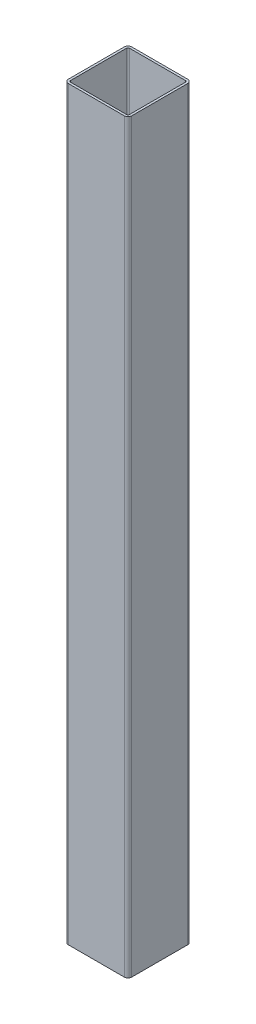
ISO-10303-21;
HEADER;
FILE_DESCRIPTION(('STEP AP214'),'2;1');
FILE_NAME('part.step','',(''),(''),'','','');
FILE_SCHEMA(('AUTOMOTIVE_DESIGN { 1 0 10303 214 1 1 1 1 }'));
ENDSEC;
DATA;
#1=APPLICATION_CONTEXT('core data for automotive mechanical design processes');
#2=APPLICATION_PROTOCOL_DEFINITION('international standard','automotive_design',2000,#1);
#3=PRODUCT_CONTEXT('',#1,'mechanical');
#4=PRODUCT('Part','Part','',(#3));
#5=PRODUCT_RELATED_PRODUCT_CATEGORY('part','',(#4));
#6=PRODUCT_DEFINITION_FORMATION('','',#4);
#7=PRODUCT_DEFINITION_CONTEXT('part definition',#1,'design');
#8=PRODUCT_DEFINITION('design','',#6,#7);
#9=PRODUCT_DEFINITION_SHAPE('','',#8);
#10=(LENGTH_UNIT() NAMED_UNIT(*) SI_UNIT(.MILLI.,.METRE.));
#11=(NAMED_UNIT(*) PLANE_ANGLE_UNIT() SI_UNIT($,.RADIAN.));
#12=(NAMED_UNIT(*) SI_UNIT($,.STERADIAN.) SOLID_ANGLE_UNIT());
#13=UNCERTAINTY_MEASURE_WITH_UNIT(LENGTH_MEASURE(1.E-05),#10,'distance_accuracy_value','');
#14=(GEOMETRIC_REPRESENTATION_CONTEXT(3) GLOBAL_UNCERTAINTY_ASSIGNED_CONTEXT((#13)) GLOBAL_UNIT_ASSIGNED_CONTEXT((#10,
#11,#12)) REPRESENTATION_CONTEXT('',''));
#15=CARTESIAN_POINT('',(0.,0.,0.));
#16=DIRECTION('',(0.,0.,1.));
#17=DIRECTION('',(1.,0.,0.));
#18=AXIS2_PLACEMENT_3D('',#15,#16,#17);
#19=CARTESIAN_POINT('',(37.5,1000.,37.5));
#20=DIRECTION('',(0.,1.,0.));
#21=DIRECTION('',(0.,0.,1.));
#22=AXIS2_PLACEMENT_3D('',#19,#20,#21);
#23=PLANE('',#22);
#24=CARTESIAN_POINT('',(37.5,1000.,37.5));
#25=DIRECTION('',(0.,1.,0.));
#26=DIRECTION('',(0.,0.,1.));
#27=AXIS2_PLACEMENT_3D('',#24,#25,#26);
#28=CIRCLE('',#27,4.99999999999999);
#29=CARTESIAN_POINT('',(37.5,1000.,42.5));
#30=VERTEX_POINT('',#29);
#31=CARTESIAN_POINT('',(42.5,1000.,37.5));
#32=VERTEX_POINT('',#31);
#33=EDGE_CURVE('E262',#30,#32,#28,.T.);
#34=ORIENTED_EDGE('',*,*,#33,.T.);
#35=DIRECTION('',(0.,0.,-1.));
#36=VECTOR('',#35,1.);
#37=CARTESIAN_POINT('',(42.5,1000.,-37.5));
#38=LINE('',#37,#36);
#39=CARTESIAN_POINT('',(42.5,1000.,-37.5));
#40=VERTEX_POINT('',#39);
#41=EDGE_CURVE('E265',#32,#40,#38,.T.);
#42=ORIENTED_EDGE('',*,*,#41,.T.);
#43=CARTESIAN_POINT('',(37.5,1000.,-37.5));
#44=DIRECTION('',(0.,1.,0.));
#45=DIRECTION('',(0.,0.,-1.));
#46=AXIS2_PLACEMENT_3D('',#43,#44,#45);
#47=CIRCLE('',#46,5.);
#48=CARTESIAN_POINT('',(37.5,1000.,-42.5));
#49=VERTEX_POINT('',#48);
#50=EDGE_CURVE('E268',#40,#49,#47,.T.);
#51=ORIENTED_EDGE('',*,*,#50,.T.);
#52=DIRECTION('',(-1.,0.,0.));
#53=VECTOR('',#52,1.);
#54=CARTESIAN_POINT('',(-37.5,1000.,-42.5));
#55=LINE('',#54,#53);
#56=CARTESIAN_POINT('',(-37.5,1000.,-42.5));
#57=VERTEX_POINT('',#56);
#58=EDGE_CURVE('E270',#49,#57,#55,.T.);
#59=ORIENTED_EDGE('',*,*,#58,.T.);
#60=CARTESIAN_POINT('',(-37.5,1000.,-37.5));
#61=DIRECTION('',(0.,1.,0.));
#62=DIRECTION('',(0.,0.,1.));
#63=AXIS2_PLACEMENT_3D('',#60,#61,#62);
#64=CIRCLE('',#63,5.);
#65=CARTESIAN_POINT('',(-42.5,1000.,-37.5));
#66=VERTEX_POINT('',#65);
#67=EDGE_CURVE('E272',#57,#66,#64,.T.);
#68=ORIENTED_EDGE('',*,*,#67,.T.);
#69=DIRECTION('',(0.,0.,1.));
#70=VECTOR('',#69,1.);
#71=CARTESIAN_POINT('',(-42.5,1000.,-37.5));
#72=LINE('',#71,#70);
#73=CARTESIAN_POINT('',(-42.5,1000.,37.5));
#74=VERTEX_POINT('',#73);
#75=EDGE_CURVE('E274',#66,#74,#72,.T.);
#76=ORIENTED_EDGE('',*,*,#75,.T.);
#77=CARTESIAN_POINT('',(-37.5,1000.,37.5));
#78=DIRECTION('',(0.,1.,0.));
#79=DIRECTION('',(0.,0.,1.));
#80=AXIS2_PLACEMENT_3D('',#77,#78,#79);
#81=CIRCLE('',#80,5.);
#82=CARTESIAN_POINT('',(-37.5,1000.,42.5));
#83=VERTEX_POINT('',#82);
#84=EDGE_CURVE('E276',#74,#83,#81,.T.);
#85=ORIENTED_EDGE('',*,*,#84,.T.);
#86=DIRECTION('',(1.,0.,0.));
#87=VECTOR('',#86,1.);
#88=CARTESIAN_POINT('',(-37.5,1000.,42.5));
#89=LINE('',#88,#87);
#90=EDGE_CURVE('E278',#83,#30,#89,.T.);
#91=ORIENTED_EDGE('',*,*,#90,.T.);
#92=EDGE_LOOP('',(#34,#42,#51,#59,#68,#76,#85,#91));
#93=FACE_BOUND('',#92,.T.);
#94=DIRECTION('',(0.,0.,-1.));
#95=VECTOR('',#94,1.);
#96=CARTESIAN_POINT('',(39.5,1000.,-37.5));
#97=LINE('',#96,#95);
#98=CARTESIAN_POINT('',(39.5,1000.,37.5));
#99=VERTEX_POINT('',#98);
#100=CARTESIAN_POINT('',(39.5,1000.,-37.5));
#101=VERTEX_POINT('',#100);
#102=EDGE_CURVE('E205',#99,#101,#97,.T.);
#103=ORIENTED_EDGE('',*,*,#102,.F.);
#104=CARTESIAN_POINT('',(37.5,1000.,37.5));
#105=DIRECTION('',(0.,1.,0.));
#106=DIRECTION('',(1.,0.,0.));
#107=AXIS2_PLACEMENT_3D('',#104,#105,#106);
#108=CIRCLE('',#107,1.99999999999999);
#109=CARTESIAN_POINT('',(37.5,1000.,39.5));
#110=VERTEX_POINT('',#109);
#111=EDGE_CURVE('E197',#110,#99,#108,.T.);
#112=ORIENTED_EDGE('',*,*,#111,.F.);
#113=DIRECTION('',(1.,0.,0.));
#114=VECTOR('',#113,1.);
#115=CARTESIAN_POINT('',(-37.5,1000.,39.5));
#116=LINE('',#115,#114);
#117=CARTESIAN_POINT('',(-37.5,1000.,39.5));
#118=VERTEX_POINT('',#117);
#119=EDGE_CURVE('E230',#118,#110,#116,.T.);
#120=ORIENTED_EDGE('',*,*,#119,.F.);
#121=CARTESIAN_POINT('',(-37.5,1000.,37.5));
#122=DIRECTION('',(0.,1.,0.));
#123=DIRECTION('',(1.,0.,0.));
#124=AXIS2_PLACEMENT_3D('',#121,#122,#123);
#125=CIRCLE('',#124,2.);
#126=CARTESIAN_POINT('',(-39.5,1000.,37.5));
#127=VERTEX_POINT('',#126);
#128=EDGE_CURVE('E228',#127,#118,#125,.T.);
#129=ORIENTED_EDGE('',*,*,#128,.F.);
#130=DIRECTION('',(0.,0.,1.));
#131=VECTOR('',#130,1.);
#132=CARTESIAN_POINT('',(-39.5,1000.,-37.5));
#133=LINE('',#132,#131);
#134=CARTESIAN_POINT('',(-39.5,1000.,-37.5));
#135=VERTEX_POINT('',#134);
#136=EDGE_CURVE('E226',#135,#127,#133,.T.);
#137=ORIENTED_EDGE('',*,*,#136,.F.);
#138=CARTESIAN_POINT('',(-37.5,1000.,-37.5));
#139=DIRECTION('',(0.,1.,0.));
#140=DIRECTION('',(1.,0.,0.));
#141=AXIS2_PLACEMENT_3D('',#138,#139,#140);
#142=CIRCLE('',#141,2.);
#143=CARTESIAN_POINT('',(-37.5,1000.,-39.5));
#144=VERTEX_POINT('',#143);
#145=EDGE_CURVE('E224',#144,#135,#142,.T.);
#146=ORIENTED_EDGE('',*,*,#145,.F.);
#147=DIRECTION('',(-1.,0.,0.));
#148=VECTOR('',#147,1.);
#149=CARTESIAN_POINT('',(-37.5,1000.,-39.5));
#150=LINE('',#149,#148);
#151=CARTESIAN_POINT('',(37.5,1000.,-39.5));
#152=VERTEX_POINT('',#151);
#153=EDGE_CURVE('E220',#152,#144,#150,.T.);
#154=ORIENTED_EDGE('',*,*,#153,.F.);
#155=CARTESIAN_POINT('',(37.5,1000.,-37.5));
#156=DIRECTION('',(0.,1.,0.));
#157=DIRECTION('',(1.,0.,0.));
#158=AXIS2_PLACEMENT_3D('',#155,#156,#157);
#159=CIRCLE('',#158,2.);
#160=EDGE_CURVE('E218',#101,#152,#159,.T.);
#161=ORIENTED_EDGE('',*,*,#160,.F.);
#162=EDGE_LOOP('',(#103,#112,#120,#129,#137,#146,#154,#161));
#163=FACE_BOUND('',#162,.T.);
#164=ADVANCED_FACE('F84',(#93,#163),#23,.T.);
#165=CARTESIAN_POINT('',(37.5,0.,37.5));
#166=DIRECTION('',(0.,1.,0.));
#167=DIRECTION('',(0.,0.,1.));
#168=AXIS2_PLACEMENT_3D('',#165,#166,#167);
#169=PLANE('',#168);
#170=CARTESIAN_POINT('',(37.5,0.,37.5));
#171=DIRECTION('',(0.,1.,0.));
#172=DIRECTION('',(0.,0.,1.));
#173=AXIS2_PLACEMENT_3D('',#170,#171,#172);
#174=CIRCLE('',#173,4.99999999999999);
#175=CARTESIAN_POINT('',(37.5,0.,42.5));
#176=VERTEX_POINT('',#175);
#177=CARTESIAN_POINT('',(42.5,0.,37.5));
#178=VERTEX_POINT('',#177);
#179=EDGE_CURVE('E213',#176,#178,#174,.T.);
#180=ORIENTED_EDGE('',*,*,#179,.F.);
#181=DIRECTION('',(1.,0.,0.));
#182=VECTOR('',#181,1.);
#183=CARTESIAN_POINT('',(-37.5,0.,42.5));
#184=LINE('',#183,#182);
#185=CARTESIAN_POINT('',(-37.5,0.,42.5));
#186=VERTEX_POINT('',#185);
#187=EDGE_CURVE('E266',#186,#176,#184,.T.);
#188=ORIENTED_EDGE('',*,*,#187,.F.);
#189=CARTESIAN_POINT('',(-37.5,0.,37.5));
#190=DIRECTION('',(0.,1.,0.));
#191=DIRECTION('',(0.,0.,1.));
#192=AXIS2_PLACEMENT_3D('',#189,#190,#191);
#193=CIRCLE('',#192,5.);
#194=CARTESIAN_POINT('',(-42.5,0.,37.5));
#195=VERTEX_POINT('',#194);
#196=EDGE_CURVE('E293',#195,#186,#193,.T.);
#197=ORIENTED_EDGE('',*,*,#196,.F.);
#198=DIRECTION('',(0.,0.,1.));
#199=VECTOR('',#198,1.);
#200=CARTESIAN_POINT('',(-42.5,0.,-37.5));
#201=LINE('',#200,#199);
#202=CARTESIAN_POINT('',(-42.5,0.,-37.5));
#203=VERTEX_POINT('',#202);
#204=EDGE_CURVE('E291',#203,#195,#201,.T.);
#205=ORIENTED_EDGE('',*,*,#204,.F.);
#206=CARTESIAN_POINT('',(-37.5,0.,-37.5));
#207=DIRECTION('',(0.,1.,0.));
#208=DIRECTION('',(0.,0.,1.));
#209=AXIS2_PLACEMENT_3D('',#206,#207,#208);
#210=CIRCLE('',#209,5.);
#211=CARTESIAN_POINT('',(-37.5,0.,-42.5));
#212=VERTEX_POINT('',#211);
#213=EDGE_CURVE('E289',#212,#203,#210,.T.);
#214=ORIENTED_EDGE('',*,*,#213,.F.);
#215=DIRECTION('',(-1.,0.,0.));
#216=VECTOR('',#215,1.);
#217=CARTESIAN_POINT('',(-37.5,0.,-42.5));
#218=LINE('',#217,#216);
#219=CARTESIAN_POINT('',(37.5,0.,-42.5));
#220=VERTEX_POINT('',#219);
#221=EDGE_CURVE('E287',#220,#212,#218,.T.);
#222=ORIENTED_EDGE('',*,*,#221,.F.);
#223=CARTESIAN_POINT('',(37.5,0.,-37.5));
#224=DIRECTION('',(0.,1.,0.));
#225=DIRECTION('',(0.,0.,-1.));
#226=AXIS2_PLACEMENT_3D('',#223,#224,#225);
#227=CIRCLE('',#226,5.);
#228=CARTESIAN_POINT('',(42.5,0.,-37.5));
#229=VERTEX_POINT('',#228);
#230=EDGE_CURVE('E285',#229,#220,#227,.T.);
#231=ORIENTED_EDGE('',*,*,#230,.F.);
#232=DIRECTION('',(0.,0.,-1.));
#233=VECTOR('',#232,1.);
#234=CARTESIAN_POINT('',(42.5,0.,-37.5));
#235=LINE('',#234,#233);
#236=EDGE_CURVE('E283',#178,#229,#235,.T.);
#237=ORIENTED_EDGE('',*,*,#236,.F.);
#238=EDGE_LOOP('',(#180,#188,#197,#205,#214,#222,#231,#237));
#239=FACE_BOUND('',#238,.T.);
#240=CARTESIAN_POINT('',(37.5,0.,37.5));
#241=DIRECTION('',(0.,1.,0.));
#242=DIRECTION('',(1.,0.,0.));
#243=AXIS2_PLACEMENT_3D('',#240,#241,#242);
#244=CIRCLE('',#243,1.99999999999999);
#245=CARTESIAN_POINT('',(37.5,0.,39.5));
#246=VERTEX_POINT('',#245);
#247=CARTESIAN_POINT('',(39.5,0.,37.5));
#248=VERTEX_POINT('',#247);
#249=EDGE_CURVE('E107',#246,#248,#244,.T.);
#250=ORIENTED_EDGE('',*,*,#249,.T.);
#251=DIRECTION('',(0.,0.,-1.));
#252=VECTOR('',#251,1.);
#253=CARTESIAN_POINT('',(39.5,0.,-37.5));
#254=LINE('',#253,#252);
#255=CARTESIAN_POINT('',(39.5,0.,-37.5));
#256=VERTEX_POINT('',#255);
#257=EDGE_CURVE('E212',#248,#256,#254,.T.);
#258=ORIENTED_EDGE('',*,*,#257,.T.);
#259=CARTESIAN_POINT('',(37.5,0.,-37.5));
#260=DIRECTION('',(0.,1.,0.));
#261=DIRECTION('',(1.,0.,0.));
#262=AXIS2_PLACEMENT_3D('',#259,#260,#261);
#263=CIRCLE('',#262,2.);
#264=CARTESIAN_POINT('',(37.5,0.,-39.5));
#265=VERTEX_POINT('',#264);
#266=EDGE_CURVE('E234',#256,#265,#263,.T.);
#267=ORIENTED_EDGE('',*,*,#266,.T.);
#268=DIRECTION('',(-1.,0.,0.));
#269=VECTOR('',#268,1.);
#270=CARTESIAN_POINT('',(-37.5,0.,-39.5));
#271=LINE('',#270,#269);
#272=CARTESIAN_POINT('',(-37.5,0.,-39.5));
#273=VERTEX_POINT('',#272);
#274=EDGE_CURVE('E237',#265,#273,#271,.T.);
#275=ORIENTED_EDGE('',*,*,#274,.T.);
#276=CARTESIAN_POINT('',(-37.5,0.,-37.5));
#277=DIRECTION('',(0.,1.,0.));
#278=DIRECTION('',(1.,0.,0.));
#279=AXIS2_PLACEMENT_3D('',#276,#277,#278);
#280=CIRCLE('',#279,2.);
#281=CARTESIAN_POINT('',(-39.5,0.,-37.5));
#282=VERTEX_POINT('',#281);
#283=EDGE_CURVE('E240',#273,#282,#280,.T.);
#284=ORIENTED_EDGE('',*,*,#283,.T.);
#285=DIRECTION('',(0.,0.,1.));
#286=VECTOR('',#285,1.);
#287=CARTESIAN_POINT('',(-39.5,0.,-37.5));
#288=LINE('',#287,#286);
#289=CARTESIAN_POINT('',(-39.5,0.,37.5));
#290=VERTEX_POINT('',#289);
#291=EDGE_CURVE('E243',#282,#290,#288,.T.);
#292=ORIENTED_EDGE('',*,*,#291,.T.);
#293=CARTESIAN_POINT('',(-37.5,0.,37.5));
#294=DIRECTION('',(0.,1.,0.));
#295=DIRECTION('',(1.,0.,0.));
#296=AXIS2_PLACEMENT_3D('',#293,#294,#295);
#297=CIRCLE('',#296,2.);
#298=CARTESIAN_POINT('',(-37.5,0.,39.5));
#299=VERTEX_POINT('',#298);
#300=EDGE_CURVE('E246',#290,#299,#297,.T.);
#301=ORIENTED_EDGE('',*,*,#300,.T.);
#302=DIRECTION('',(1.,0.,0.));
#303=VECTOR('',#302,1.);
#304=CARTESIAN_POINT('',(-37.5,0.,39.5));
#305=LINE('',#304,#303);
#306=EDGE_CURVE('E206',#299,#246,#305,.T.);
#307=ORIENTED_EDGE('',*,*,#306,.T.);
#308=EDGE_LOOP('',(#250,#258,#267,#275,#284,#292,#301,#307));
#309=FACE_BOUND('',#308,.T.);
#310=ADVANCED_FACE('F323',(#239,#309),#169,.F.);
#311=CARTESIAN_POINT('',(37.5,1000.,37.5));
#312=DIRECTION('',(0.,-1.,0.));
#313=DIRECTION('',(0.,0.,-1.));
#314=AXIS2_PLACEMENT_3D('',#311,#312,#313);
#315=CYLINDRICAL_SURFACE('',#314,4.99999999999999);
#316=ORIENTED_EDGE('',*,*,#179,.T.);
#317=DIRECTION('',(0.,-1.,0.));
#318=VECTOR('',#317,1.);
#319=CARTESIAN_POINT('',(42.5,1000.,37.5));
#320=LINE('',#319,#318);
#321=EDGE_CURVE('E12',#32,#178,#320,.T.);
#322=ORIENTED_EDGE('',*,*,#321,.F.);
#323=ORIENTED_EDGE('',*,*,#33,.F.);
#324=DIRECTION('',(0.,-1.,0.));
#325=VECTOR('',#324,1.);
#326=CARTESIAN_POINT('',(37.5,1000.,42.5));
#327=LINE('',#326,#325);
#328=EDGE_CURVE('E280',#30,#176,#327,.T.);
#329=ORIENTED_EDGE('',*,*,#328,.T.);
#330=EDGE_LOOP('',(#316,#322,#323,#329));
#331=FACE_BOUND('',#330,.T.);
#332=ADVANCED_FACE('F86',(#331),#315,.T.);
#333=CARTESIAN_POINT('',(42.5,1000.,-37.5));
#334=DIRECTION('',(-1.,0.,0.));
#335=DIRECTION('',(0.,0.,1.));
#336=AXIS2_PLACEMENT_3D('',#333,#334,#335);
#337=PLANE('',#336);
#338=ORIENTED_EDGE('',*,*,#236,.T.);
#339=DIRECTION('',(0.,-1.,0.));
#340=VECTOR('',#339,1.);
#341=CARTESIAN_POINT('',(42.5,1000.,-37.5));
#342=LINE('',#341,#340);
#343=EDGE_CURVE('E92',#40,#229,#342,.T.);
#344=ORIENTED_EDGE('',*,*,#343,.F.);
#345=ORIENTED_EDGE('',*,*,#41,.F.);
#346=ORIENTED_EDGE('',*,*,#321,.T.);
#347=EDGE_LOOP('',(#338,#344,#345,#346));
#348=FACE_BOUND('',#347,.T.);
#349=ADVANCED_FACE('F340',(#348),#337,.F.);
#350=CARTESIAN_POINT('',(37.5,1000.,-37.5));
#351=DIRECTION('',(0.,-1.,0.));
#352=DIRECTION('',(0.,0.,-1.));
#353=AXIS2_PLACEMENT_3D('',#350,#351,#352);
#354=CYLINDRICAL_SURFACE('',#353,5.);
#355=ORIENTED_EDGE('',*,*,#230,.T.);
#356=DIRECTION('',(0.,-1.,0.));
#357=VECTOR('',#356,1.);
#358=CARTESIAN_POINT('',(37.5,1000.,-42.5));
#359=LINE('',#358,#357);
#360=EDGE_CURVE('E310',#49,#220,#359,.T.);
#361=ORIENTED_EDGE('',*,*,#360,.F.);
#362=ORIENTED_EDGE('',*,*,#50,.F.);
#363=ORIENTED_EDGE('',*,*,#343,.T.);
#364=EDGE_LOOP('',(#355,#361,#362,#363));
#365=FACE_BOUND('',#364,.T.);
#366=ADVANCED_FACE('F317',(#365),#354,.T.);
#367=CARTESIAN_POINT('',(-37.5,1000.,-42.5));
#368=DIRECTION('',(0.,0.,1.));
#369=DIRECTION('',(1.,0.,0.));
#370=AXIS2_PLACEMENT_3D('',#367,#368,#369);
#371=PLANE('',#370);
#372=ORIENTED_EDGE('',*,*,#221,.T.);
#373=DIRECTION('',(0.,-1.,0.));
#374=VECTOR('',#373,1.);
#375=CARTESIAN_POINT('',(-37.5,1000.,-42.5));
#376=LINE('',#375,#374);
#377=EDGE_CURVE('E307',#57,#212,#376,.T.);
#378=ORIENTED_EDGE('',*,*,#377,.F.);
#379=ORIENTED_EDGE('',*,*,#58,.F.);
#380=ORIENTED_EDGE('',*,*,#360,.T.);
#381=EDGE_LOOP('',(#372,#378,#379,#380));
#382=FACE_BOUND('',#381,.T.);
#383=ADVANCED_FACE('F329',(#382),#371,.F.);
#384=CARTESIAN_POINT('',(-37.5,1000.,-37.5));
#385=DIRECTION('',(0.,-1.,0.));
#386=DIRECTION('',(0.,0.,-1.));
#387=AXIS2_PLACEMENT_3D('',#384,#385,#386);
#388=CYLINDRICAL_SURFACE('',#387,5.);
#389=ORIENTED_EDGE('',*,*,#213,.T.);
#390=DIRECTION('',(0.,-1.,0.));
#391=VECTOR('',#390,1.);
#392=CARTESIAN_POINT('',(-42.5,1000.,-37.5));
#393=LINE('',#392,#391);
#394=EDGE_CURVE('E304',#66,#203,#393,.T.);
#395=ORIENTED_EDGE('',*,*,#394,.F.);
#396=ORIENTED_EDGE('',*,*,#67,.F.);
#397=ORIENTED_EDGE('',*,*,#377,.T.);
#398=EDGE_LOOP('',(#389,#395,#396,#397));
#399=FACE_BOUND('',#398,.T.);
#400=ADVANCED_FACE('F333',(#399),#388,.T.);
#401=CARTESIAN_POINT('',(-42.5,1000.,-37.5));
#402=DIRECTION('',(1.,0.,0.));
#403=DIRECTION('',(0.,0.,-1.));
#404=AXIS2_PLACEMENT_3D('',#401,#402,#403);
#405=PLANE('',#404);
#406=ORIENTED_EDGE('',*,*,#204,.T.);
#407=DIRECTION('',(0.,-1.,0.));
#408=VECTOR('',#407,1.);
#409=CARTESIAN_POINT('',(-42.5,1000.,37.5));
#410=LINE('',#409,#408);
#411=EDGE_CURVE('E301',#74,#195,#410,.T.);
#412=ORIENTED_EDGE('',*,*,#411,.F.);
#413=ORIENTED_EDGE('',*,*,#75,.F.);
#414=ORIENTED_EDGE('',*,*,#394,.T.);
#415=EDGE_LOOP('',(#406,#412,#413,#414));
#416=FACE_BOUND('',#415,.T.);
#417=ADVANCED_FACE('F353',(#416),#405,.F.);
#418=CARTESIAN_POINT('',(-37.5,1000.,37.5));
#419=DIRECTION('',(0.,-1.,0.));
#420=DIRECTION('',(0.,0.,-1.));
#421=AXIS2_PLACEMENT_3D('',#418,#419,#420);
#422=CYLINDRICAL_SURFACE('',#421,5.);
#423=ORIENTED_EDGE('',*,*,#196,.T.);
#424=DIRECTION('',(0.,-1.,0.));
#425=VECTOR('',#424,1.);
#426=CARTESIAN_POINT('',(-37.5,1000.,42.5));
#427=LINE('',#426,#425);
#428=EDGE_CURVE('E298',#83,#186,#427,.T.);
#429=ORIENTED_EDGE('',*,*,#428,.F.);
#430=ORIENTED_EDGE('',*,*,#84,.F.);
#431=ORIENTED_EDGE('',*,*,#411,.T.);
#432=EDGE_LOOP('',(#423,#429,#430,#431));
#433=FACE_BOUND('',#432,.T.);
#434=ADVANCED_FACE('F351',(#433),#422,.T.);
#435=CARTESIAN_POINT('',(-37.5,1000.,42.5));
#436=DIRECTION('',(0.,0.,-1.));
#437=DIRECTION('',(-1.,0.,0.));
#438=AXIS2_PLACEMENT_3D('',#435,#436,#437);
#439=PLANE('',#438);
#440=ORIENTED_EDGE('',*,*,#187,.T.);
#441=ORIENTED_EDGE('',*,*,#328,.F.);
#442=ORIENTED_EDGE('',*,*,#90,.F.);
#443=ORIENTED_EDGE('',*,*,#428,.T.);
#444=EDGE_LOOP('',(#440,#441,#442,#443));
#445=FACE_BOUND('',#444,.T.);
#446=ADVANCED_FACE('F346',(#445),#439,.F.);
#447=CARTESIAN_POINT('',(37.5,1000.,37.5));
#448=DIRECTION('',(0.,-1.,0.));
#449=DIRECTION('',(0.,0.,-1.));
#450=AXIS2_PLACEMENT_3D('',#447,#448,#449);
#451=CYLINDRICAL_SURFACE('',#450,1.99999999999999);
#452=ORIENTED_EDGE('',*,*,#249,.F.);
#453=DIRECTION('',(0.,-1.,0.));
#454=VECTOR('',#453,1.);
#455=CARTESIAN_POINT('',(37.5,1000.,39.5));
#456=LINE('',#455,#454);
#457=EDGE_CURVE('E201',#110,#246,#456,.T.);
#458=ORIENTED_EDGE('',*,*,#457,.F.);
#459=ORIENTED_EDGE('',*,*,#111,.T.);
#460=DIRECTION('',(0.,-1.,0.));
#461=VECTOR('',#460,1.);
#462=CARTESIAN_POINT('',(39.5,1000.,37.5));
#463=LINE('',#462,#461);
#464=EDGE_CURVE('E200',#99,#248,#463,.T.);
#465=ORIENTED_EDGE('',*,*,#464,.T.);
#466=EDGE_LOOP('',(#452,#458,#459,#465));
#467=FACE_BOUND('',#466,.T.);
#468=ADVANCED_FACE('F199',(#467),#451,.F.);
#469=CARTESIAN_POINT('',(39.5,1000.,-37.5));
#470=DIRECTION('',(-1.,0.,0.));
#471=DIRECTION('',(0.,0.,1.));
#472=AXIS2_PLACEMENT_3D('',#469,#470,#471);
#473=PLANE('',#472);
#474=ORIENTED_EDGE('',*,*,#257,.F.);
#475=ORIENTED_EDGE('',*,*,#464,.F.);
#476=ORIENTED_EDGE('',*,*,#102,.T.);
#477=DIRECTION('',(0.,-1.,0.));
#478=VECTOR('',#477,1.);
#479=CARTESIAN_POINT('',(39.5,1000.,-37.5));
#480=LINE('',#479,#478);
#481=EDGE_CURVE('E214',#101,#256,#480,.T.);
#482=ORIENTED_EDGE('',*,*,#481,.T.);
#483=EDGE_LOOP('',(#474,#475,#476,#482));
#484=FACE_BOUND('',#483,.T.);
#485=ADVANCED_FACE('F209',(#484),#473,.T.);
#486=CARTESIAN_POINT('',(37.5,1000.,-37.5));
#487=DIRECTION('',(0.,-1.,0.));
#488=DIRECTION('',(0.,0.,-1.));
#489=AXIS2_PLACEMENT_3D('',#486,#487,#488);
#490=CYLINDRICAL_SURFACE('',#489,2.);
#491=ORIENTED_EDGE('',*,*,#266,.F.);
#492=ORIENTED_EDGE('',*,*,#481,.F.);
#493=ORIENTED_EDGE('',*,*,#160,.T.);
#494=DIRECTION('',(0.,-1.,0.));
#495=VECTOR('',#494,1.);
#496=CARTESIAN_POINT('',(37.5,1000.,-39.5));
#497=LINE('',#496,#495);
#498=EDGE_CURVE('E259',#152,#265,#497,.T.);
#499=ORIENTED_EDGE('',*,*,#498,.T.);
#500=EDGE_LOOP('',(#491,#492,#493,#499));
#501=FACE_BOUND('',#500,.T.);
#502=ADVANCED_FACE('F378',(#501),#490,.F.);
#503=CARTESIAN_POINT('',(-37.5,1000.,-39.5));
#504=DIRECTION('',(0.,0.,1.));
#505=DIRECTION('',(1.,0.,0.));
#506=AXIS2_PLACEMENT_3D('',#503,#504,#505);
#507=PLANE('',#506);
#508=ORIENTED_EDGE('',*,*,#274,.F.);
#509=ORIENTED_EDGE('',*,*,#498,.F.);
#510=ORIENTED_EDGE('',*,*,#153,.T.);
#511=DIRECTION('',(0.,-1.,0.));
#512=VECTOR('',#511,1.);
#513=CARTESIAN_POINT('',(-37.5,1000.,-39.5));
#514=LINE('',#513,#512);
#515=EDGE_CURVE('E257',#144,#273,#514,.T.);
#516=ORIENTED_EDGE('',*,*,#515,.T.);
#517=EDGE_LOOP('',(#508,#509,#510,#516));
#518=FACE_BOUND('',#517,.T.);
#519=ADVANCED_FACE('F382',(#518),#507,.T.);
#520=CARTESIAN_POINT('',(-37.5,1000.,-37.5));
#521=DIRECTION('',(0.,-1.,0.));
#522=DIRECTION('',(0.,0.,-1.));
#523=AXIS2_PLACEMENT_3D('',#520,#521,#522);
#524=CYLINDRICAL_SURFACE('',#523,2.);
#525=ORIENTED_EDGE('',*,*,#283,.F.);
#526=ORIENTED_EDGE('',*,*,#515,.F.);
#527=ORIENTED_EDGE('',*,*,#145,.T.);
#528=DIRECTION('',(0.,-1.,0.));
#529=VECTOR('',#528,1.);
#530=CARTESIAN_POINT('',(-39.5,1000.,-37.5));
#531=LINE('',#530,#529);
#532=EDGE_CURVE('E255',#135,#282,#531,.T.);
#533=ORIENTED_EDGE('',*,*,#532,.T.);
#534=EDGE_LOOP('',(#525,#526,#527,#533));
#535=FACE_BOUND('',#534,.T.);
#536=ADVANCED_FACE('F388',(#535),#524,.F.);
#537=CARTESIAN_POINT('',(-39.5,1000.,-37.5));
#538=DIRECTION('',(1.,0.,0.));
#539=DIRECTION('',(0.,0.,-1.));
#540=AXIS2_PLACEMENT_3D('',#537,#538,#539);
#541=PLANE('',#540);
#542=ORIENTED_EDGE('',*,*,#291,.F.);
#543=ORIENTED_EDGE('',*,*,#532,.F.);
#544=ORIENTED_EDGE('',*,*,#136,.T.);
#545=DIRECTION('',(0.,-1.,0.));
#546=VECTOR('',#545,1.);
#547=CARTESIAN_POINT('',(-39.5,1000.,37.5));
#548=LINE('',#547,#546);
#549=EDGE_CURVE('E253',#127,#290,#548,.T.);
#550=ORIENTED_EDGE('',*,*,#549,.T.);
#551=EDGE_LOOP('',(#542,#543,#544,#550));
#552=FACE_BOUND('',#551,.T.);
#553=ADVANCED_FACE('F392',(#552),#541,.T.);
#554=CARTESIAN_POINT('',(-37.5,1000.,37.5));
#555=DIRECTION('',(0.,-1.,0.));
#556=DIRECTION('',(0.,0.,-1.));
#557=AXIS2_PLACEMENT_3D('',#554,#555,#556);
#558=CYLINDRICAL_SURFACE('',#557,2.);
#559=ORIENTED_EDGE('',*,*,#300,.F.);
#560=ORIENTED_EDGE('',*,*,#549,.F.);
#561=ORIENTED_EDGE('',*,*,#128,.T.);
#562=DIRECTION('',(0.,-1.,0.));
#563=VECTOR('',#562,1.);
#564=CARTESIAN_POINT('',(-37.5,1000.,39.5));
#565=LINE('',#564,#563);
#566=EDGE_CURVE('E99',#118,#299,#565,.T.);
#567=ORIENTED_EDGE('',*,*,#566,.T.);
#568=EDGE_LOOP('',(#559,#560,#561,#567));
#569=FACE_BOUND('',#568,.T.);
#570=ADVANCED_FACE('F396',(#569),#558,.F.);
#571=CARTESIAN_POINT('',(-37.5,1000.,39.5));
#572=DIRECTION('',(0.,0.,-1.));
#573=DIRECTION('',(-1.,0.,0.));
#574=AXIS2_PLACEMENT_3D('',#571,#572,#573);
#575=PLANE('',#574);
#576=ORIENTED_EDGE('',*,*,#306,.F.);
#577=ORIENTED_EDGE('',*,*,#566,.F.);
#578=ORIENTED_EDGE('',*,*,#119,.T.);
#579=ORIENTED_EDGE('',*,*,#457,.T.);
#580=EDGE_LOOP('',(#576,#577,#578,#579));
#581=FACE_BOUND('',#580,.T.);
#582=ADVANCED_FACE('F400',(#581),#575,.T.);
#583=CLOSED_SHELL('',(#164,#310,#332,#349,#366,#383,#400,#417,#434,#446,#468,#485,#502,#519,
#536,#553,#570,#582));
#584=MANIFOLD_SOLID_BREP('B2',#583);
#585=ADVANCED_BREP_SHAPE_REPRESENTATION('',(#18,#584),#14);
#586=SHAPE_DEFINITION_REPRESENTATION(#9,#585);
ENDSEC;
END-ISO-10303-21;
